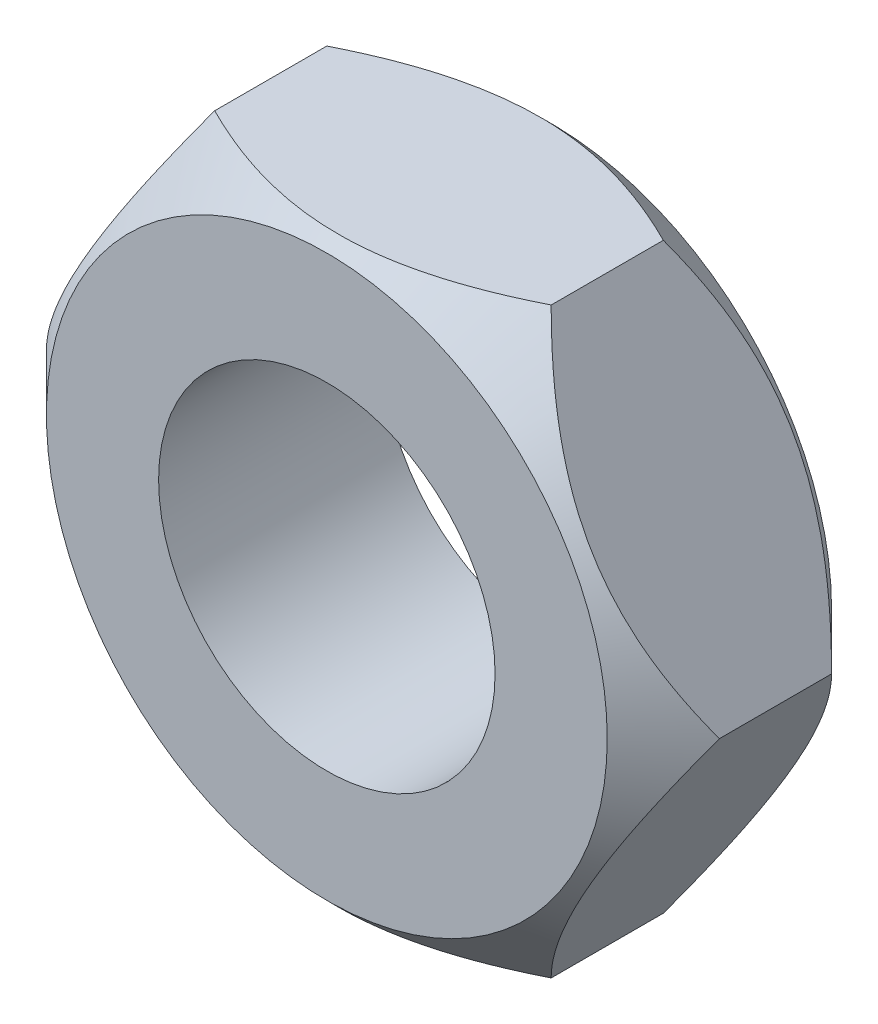
ISO-10303-21;
HEADER;
FILE_DESCRIPTION(('STEP AP214'),'2;1');
FILE_NAME('part.step','',(''),(''),'','','');
FILE_SCHEMA(('AUTOMOTIVE_DESIGN { 1 0 10303 214 1 1 1 1 }'));
ENDSEC;
DATA;
#1=APPLICATION_CONTEXT('core data for automotive mechanical design processes');
#2=APPLICATION_PROTOCOL_DEFINITION('international standard','automotive_design',2000,#1);
#3=PRODUCT_CONTEXT('',#1,'mechanical');
#4=PRODUCT('Part','Part','',(#3));
#5=PRODUCT_RELATED_PRODUCT_CATEGORY('part','',(#4));
#6=PRODUCT_DEFINITION_FORMATION('','',#4);
#7=PRODUCT_DEFINITION_CONTEXT('part definition',#1,'design');
#8=PRODUCT_DEFINITION('design','',#6,#7);
#9=PRODUCT_DEFINITION_SHAPE('','',#8);
#10=(LENGTH_UNIT() NAMED_UNIT(*) SI_UNIT(.MILLI.,.METRE.));
#11=(NAMED_UNIT(*) PLANE_ANGLE_UNIT() SI_UNIT($,.RADIAN.));
#12=(NAMED_UNIT(*) SI_UNIT($,.STERADIAN.) SOLID_ANGLE_UNIT());
#13=UNCERTAINTY_MEASURE_WITH_UNIT(LENGTH_MEASURE(1.E-05),#10,'distance_accuracy_value','');
#14=(GEOMETRIC_REPRESENTATION_CONTEXT(3) GLOBAL_UNCERTAINTY_ASSIGNED_CONTEXT((#13)) GLOBAL_UNIT_ASSIGNED_CONTEXT((#10,
#11,#12)) REPRESENTATION_CONTEXT('',''));
#15=CARTESIAN_POINT('',(0.,0.,0.));
#16=DIRECTION('',(0.,0.,1.));
#17=DIRECTION('',(1.,0.,0.));
#18=AXIS2_PLACEMENT_3D('',#15,#16,#17);
#19=CARTESIAN_POINT('',(0.,0.,-3.));
#20=DIRECTION('',(0.,0.,1.));
#21=DIRECTION('',(1.,0.,0.));
#22=AXIS2_PLACEMENT_3D('',#19,#20,#21);
#23=PLANE('',#22);
#24=CARTESIAN_POINT('',(0.,0.,-3.));
#25=DIRECTION('',(0.,0.,1.));
#26=DIRECTION('',(1.,0.,0.));
#27=AXIS2_PLACEMENT_3D('',#24,#25,#26);
#28=CIRCLE('',#27,4.5);
#29=CARTESIAN_POINT('',(4.5,0.,-3.));
#30=VERTEX_POINT('',#29);
#31=EDGE_CURVE('E206',#30,#30,#28,.T.);
#32=ORIENTED_EDGE('',*,*,#31,.T.);
#33=EDGE_LOOP('',(#32));
#34=FACE_BOUND('',#33,.T.);
#35=CARTESIAN_POINT('',(0.,0.,-3.));
#36=DIRECTION('',(0.,0.,1.));
#37=DIRECTION('',(1.,0.,0.));
#38=AXIS2_PLACEMENT_3D('',#35,#36,#37);
#39=CIRCLE('',#38,7.5);
#40=CARTESIAN_POINT('',(7.5,0.,-3.));
#41=VERTEX_POINT('',#40);
#42=EDGE_CURVE('E99',#41,#41,#39,.T.);
#43=ORIENTED_EDGE('',*,*,#42,.F.);
#44=EDGE_LOOP('',(#43));
#45=FACE_BOUND('',#44,.T.);
#46=ADVANCED_FACE('F35',(#34,#45),#23,.F.);
#47=CARTESIAN_POINT('',(0.,0.,3.));
#48=DIRECTION('',(0.,0.,1.));
#49=DIRECTION('',(1.,0.,0.));
#50=AXIS2_PLACEMENT_3D('',#47,#48,#49);
#51=PLANE('',#50);
#52=CARTESIAN_POINT('',(0.,0.,3.));
#53=DIRECTION('',(0.,0.,1.));
#54=DIRECTION('',(1.,0.,0.));
#55=AXIS2_PLACEMENT_3D('',#52,#53,#54);
#56=CIRCLE('',#55,4.5);
#57=CARTESIAN_POINT('',(4.5,0.,3.));
#58=VERTEX_POINT('',#57);
#59=EDGE_CURVE('E115',#58,#58,#56,.T.);
#60=ORIENTED_EDGE('',*,*,#59,.F.);
#61=EDGE_LOOP('',(#60));
#62=FACE_BOUND('',#61,.T.);
#63=CARTESIAN_POINT('',(0.,0.,3.));
#64=DIRECTION('',(0.,0.,1.));
#65=DIRECTION('',(1.,0.,0.));
#66=AXIS2_PLACEMENT_3D('',#63,#64,#65);
#67=CIRCLE('',#66,7.5);
#68=CARTESIAN_POINT('',(7.5,0.,3.));
#69=VERTEX_POINT('',#68);
#70=EDGE_CURVE('E135',#69,#69,#67,.T.);
#71=ORIENTED_EDGE('',*,*,#70,.T.);
#72=EDGE_LOOP('',(#71));
#73=FACE_BOUND('',#72,.T.);
#74=ADVANCED_FACE('F223',(#62,#73),#51,.T.);
#75=CARTESIAN_POINT('',(9.,0.,3.));
#76=DIRECTION('',(-0.866025403784438,-0.500000000000001,0.));
#77=DIRECTION('',(0.500000000000001,-0.866025403784438,0.));
#78=AXIS2_PLACEMENT_3D('',#75,#76,#77);
#79=PLANE('',#78);
#80=DIRECTION('',(0.,0.,-1.));
#81=VECTOR('',#80,1.);
#82=CARTESIAN_POINT('',(9.,0.,3.));
#83=LINE('',#82,#81);
#84=CARTESIAN_POINT('',(9.,0.,1.5));
#85=VERTEX_POINT('',#84);
#86=CARTESIAN_POINT('',(9.,0.,-1.5));
#87=VERTEX_POINT('',#86);
#88=EDGE_CURVE('E111',#85,#87,#83,.T.);
#89=ORIENTED_EDGE('',*,*,#88,.T.);
#90=CARTESIAN_POINT('',(9.00011547005384,-0.000199999999994475,-1.49988452772397));
#91=CARTESIAN_POINT('',(8.92274192405641,0.133814912829313,-1.57724943822115));
#92=CARTESIAN_POINT('',(8.84477365268686,0.268859920219705,-1.65224010470585));
#93=CARTESIAN_POINT('',(8.68753098792721,0.541212204700925,-1.7967507275746));
#94=CARTESIAN_POINT('',(8.60825590938334,0.678520668512924,-1.8662676961683));
#95=CARTESIAN_POINT('',(8.36755901297594,1.09541992231468,-2.06611750189363));
#96=CARTESIAN_POINT('',(8.20409960905326,1.3785399148837,-2.18689671096131));
#97=CARTESIAN_POINT('',(7.87447067401673,1.94947397801179,-2.39372263743865));
#98=CARTESIAN_POINT('',(7.7083853884696,2.237142130969,-2.48029040430474));
#99=CARTESIAN_POINT('',(7.45652703907505,2.6733735884308,-2.58042793344482));
#100=CARTESIAN_POINT('',(7.37220346119144,2.81942630960118,-2.60884136548566));
#101=CARTESIAN_POINT('',(7.20284235219017,3.1127683552176,-2.65512056900799));
#102=CARTESIAN_POINT('',(7.1178049296914,3.26005749153018,-2.67298791670453));
#103=CARTESIAN_POINT('',(6.91057889128185,3.61898351870673,-2.70294525162354));
#104=CARTESIAN_POINT('',(6.78816699516487,3.83100714223218,-2.70923068335258));
#105=CARTESIAN_POINT('',(6.54356384849813,4.2546722199502,-2.69867971969579));
#106=CARTESIAN_POINT('',(6.42137269032257,4.46631351414595,-2.68183521936724));
#107=CARTESIAN_POINT('',(6.17814239042265,4.88760075151283,-2.62601731093404));
#108=CARTESIAN_POINT('',(6.05710469109561,5.09724419637851,-2.58701915721181));
#109=CARTESIAN_POINT('',(5.81710964124361,5.51292781628721,-2.48901412107608));
#110=CARTESIAN_POINT('',(5.69815213192896,5.71896826636201,-2.43000877296914));
#111=CARTESIAN_POINT('',(5.48698431963075,6.08472164618569,-2.30861852742429));
#112=CARTESIAN_POINT('',(5.39430636677162,6.24524456927917,-2.24942654058235));
#113=CARTESIAN_POINT('',(5.21061408423922,6.56340893558359,-2.12150426182083));
#114=CARTESIAN_POINT('',(5.11959980504949,6.72105029135446,-2.05277368099819));
#115=CARTESIAN_POINT('',(4.93952153885177,7.03295499774782,-1.90731482672894));
#116=CARTESIAN_POINT('',(4.8504524303837,7.18722721899939,-1.83061170476549));
#117=CARTESIAN_POINT('',(4.67396346850877,7.49291506794184,-1.67021472494556));
#118=CARTESIAN_POINT('',(4.58654264354489,7.64433237841887,-1.58652515379037));
#119=CARTESIAN_POINT('',(4.49988452994616,7.79442863405995,-1.49988452772397));
#120=B_SPLINE_CURVE_WITH_KNOTS('',3,(#90,#91,#92,#93,#94,#95,#96,#97,#98,#99,#100,#101,#102,
#103,#104,#105,#106,#107,#108,#109,#110,#111,#112,#113,#114,#115,#116,#117,#118,#119),
.UNSPECIFIED.,.F.,.F.,(4,2,2,2,2,2,2,2,2,2,2,2,2,2,4),(0.,0.518995570787867,1.03827249662172,
2.08243235310213,3.11001247476867,3.62279481108641,4.13550048766921,4.86907230716034,
5.60290124262732,6.33755148088631,7.07214539321498,7.65560480846295,8.23908189927372,
8.82077112592717,9.40210603032024),.UNSPECIFIED.);
#121=CARTESIAN_POINT('',(4.5,7.79422863405995,-1.50000000000001));
#122=VERTEX_POINT('',#121);
#123=EDGE_CURVE('E56',#87,#122,#120,.T.);
#124=ORIENTED_EDGE('',*,*,#123,.T.);
#125=DIRECTION('',(0.,0.,-1.));
#126=VECTOR('',#125,1.);
#127=CARTESIAN_POINT('',(4.5,7.79422863405995,3.));
#128=LINE('',#127,#126);
#129=CARTESIAN_POINT('',(4.5,7.79422863405995,1.50000000000001));
#130=VERTEX_POINT('',#129);
#131=EDGE_CURVE('E49',#130,#122,#128,.T.);
#132=ORIENTED_EDGE('',*,*,#131,.F.);
#133=CARTESIAN_POINT('',(9.00011547005384,-0.000199999999994475,1.49988452772397));
#134=CARTESIAN_POINT('',(8.92274192405641,0.133814912829313,1.57724943822115));
#135=CARTESIAN_POINT('',(8.84477365268686,0.268859920219705,1.65224010470585));
#136=CARTESIAN_POINT('',(8.68753098792721,0.541212204700925,1.7967507275746));
#137=CARTESIAN_POINT('',(8.60825590938334,0.678520668512924,1.8662676961683));
#138=CARTESIAN_POINT('',(8.36755901297594,1.09541992231468,2.06611750189363));
#139=CARTESIAN_POINT('',(8.20409960905326,1.3785399148837,2.18689671096131));
#140=CARTESIAN_POINT('',(7.87447067401673,1.94947397801179,2.39372263743865));
#141=CARTESIAN_POINT('',(7.7083853884696,2.237142130969,2.48029040430474));
#142=CARTESIAN_POINT('',(7.45652703907505,2.6733735884308,2.58042793344482));
#143=CARTESIAN_POINT('',(7.37220346119144,2.81942630960118,2.60884136548566));
#144=CARTESIAN_POINT('',(7.20284235219017,3.1127683552176,2.65512056900799));
#145=CARTESIAN_POINT('',(7.1178049296914,3.26005749153018,2.67298791670453));
#146=CARTESIAN_POINT('',(6.91057889128185,3.61898351870673,2.70294525162354));
#147=CARTESIAN_POINT('',(6.78816699516487,3.83100714223218,2.70923068335258));
#148=CARTESIAN_POINT('',(6.54356384849813,4.2546722199502,2.69867971969579));
#149=CARTESIAN_POINT('',(6.42137269032257,4.46631351414595,2.68183521936724));
#150=CARTESIAN_POINT('',(6.17814239042265,4.88760075151283,2.62601731093404));
#151=CARTESIAN_POINT('',(6.05710469109561,5.09724419637851,2.58701915721181));
#152=CARTESIAN_POINT('',(5.81710964124361,5.51292781628721,2.48901412107608));
#153=CARTESIAN_POINT('',(5.69815213192896,5.71896826636201,2.43000877296914));
#154=CARTESIAN_POINT('',(5.48698431963075,6.08472164618569,2.30861852742429));
#155=CARTESIAN_POINT('',(5.39430636677162,6.24524456927917,2.24942654058235));
#156=CARTESIAN_POINT('',(5.21061408423922,6.56340893558359,2.12150426182083));
#157=CARTESIAN_POINT('',(5.11959980504949,6.72105029135446,2.05277368099819));
#158=CARTESIAN_POINT('',(4.93952153885177,7.03295499774782,1.90731482672894));
#159=CARTESIAN_POINT('',(4.8504524303837,7.18722721899939,1.83061170476549));
#160=CARTESIAN_POINT('',(4.67396346850877,7.49291506794184,1.67021472494556));
#161=CARTESIAN_POINT('',(4.58654264354489,7.64433237841887,1.58652515379037));
#162=CARTESIAN_POINT('',(4.49988452994616,7.79442863405995,1.49988452772397));
#163=B_SPLINE_CURVE_WITH_KNOTS('',3,(#133,#134,#135,#136,#137,#138,#139,#140,#141,#142,#143,
#144,#145,#146,#147,#148,#149,#150,#151,#152,#153,#154,#155,#156,#157,#158,#159,#160,#161,#162),
.UNSPECIFIED.,.F.,.F.,(4,2,2,2,2,2,2,2,2,2,2,2,2,2,4),(0.,0.518995570787867,1.03827249662172,
2.08243235310213,3.11001247476867,3.62279481108641,4.13550048766921,4.86907230716034,
5.60290124262732,6.33755148088631,7.07214539321498,7.65560480846295,8.23908189927372,
8.82077112592717,9.40210603032024),.UNSPECIFIED.);
#164=EDGE_CURVE('E134',#85,#130,#163,.T.);
#165=ORIENTED_EDGE('',*,*,#164,.F.);
#166=EDGE_LOOP('',(#89,#124,#132,#165));
#167=FACE_BOUND('',#166,.T.);
#168=ADVANCED_FACE('F37',(#167),#79,.F.);
#169=CARTESIAN_POINT('',(4.5,7.79422863405995,3.));
#170=DIRECTION('',(0.,-1.,0.));
#171=DIRECTION('',(1.,0.,0.));
#172=AXIS2_PLACEMENT_3D('',#169,#170,#171);
#173=PLANE('',#172);
#174=ORIENTED_EDGE('',*,*,#131,.T.);
#175=CARTESIAN_POINT('',(-11.1620991563945,7.79422863405995,3.11405367909144));
#176=CARTESIAN_POINT('',(-10.8810869819897,7.79422863405995,2.88371165831841));
#177=CARTESIAN_POINT('',(-10.5987192731637,7.79422863405995,2.65499724579427));
#178=CARTESIAN_POINT('',(-10.0305829496493,7.79422863405995,2.20168680077618));
#179=CARTESIAN_POINT('',(-9.74481348740401,7.79422863405995,1.97709183163361));
#180=CARTESIAN_POINT('',(-9.16616685112919,7.79422863405995,1.53056360532577));
#181=CARTESIAN_POINT('',(-8.87324608689188,7.79422863405995,1.30868665113608));
#182=CARTESIAN_POINT('',(-8.28256255023502,7.79422863405995,0.871515461516553));
#183=CARTESIAN_POINT('',(-7.98480024809745,7.79422863405995,0.656220592519402));
#184=CARTESIAN_POINT('',(-7.3553950847762,7.79422863405995,0.214334525646056));
#185=CARTESIAN_POINT('',(-7.02317803755004,7.79422863405995,-0.0114433282564525));
#186=CARTESIAN_POINT('',(-6.34992805988584,7.79422863405995,-0.449813607892143));
#187=CARTESIAN_POINT('',(-6.00889230510091,7.79422863405995,-0.662401733387896));
#188=CARTESIAN_POINT('',(-5.31775906825529,7.79422863405995,-1.06863279468781));
#189=CARTESIAN_POINT('',(-4.96771086802595,7.79422863405995,-1.26235891072349));
#190=CARTESIAN_POINT('',(-4.25514432029652,7.79422863405995,-1.62518521968849));
#191=CARTESIAN_POINT('',(-3.89263707910389,7.79422863405995,-1.7943066762917));
#192=CARTESIAN_POINT('',(-3.39139720162611,7.79422863405995,-2.00075180801446));
#193=CARTESIAN_POINT('',(-3.25872196841599,7.79422863405995,-2.05287494835824));
#194=CARTESIAN_POINT('',(-2.99157923067838,7.79422863405995,-2.15229652975814));
#195=CARTESIAN_POINT('',(-2.85711174278118,7.79422863405995,-2.19959501554694));
#196=CARTESIAN_POINT('',(-2.45099105687163,7.79422863405995,-2.33347808757297));
#197=CARTESIAN_POINT('',(-2.1766139654806,7.79422863405995,-2.41205266934888));
#198=CARTESIAN_POINT('',(-1.62783365357109,7.79422863405995,-2.54195773075186));
#199=CARTESIAN_POINT('',(-1.35356614697257,7.79422863405995,-2.59385412929673));
#200=CARTESIAN_POINT('',(-0.801142304316664,7.79422863405995,-2.66947632315582));
#201=CARTESIAN_POINT('',(-0.522986907084007,7.79422863405995,-2.69320880436159));
#202=CARTESIAN_POINT('',(0.0198477780860744,7.79422863405995,-2.71022284243772));
#203=CARTESIAN_POINT('',(0.284479833998433,7.79422863405995,-2.70501613467059));
#204=CARTESIAN_POINT('',(0.811863094645393,7.79422863405995,-2.66802101865809));
#205=CARTESIAN_POINT('',(1.07461416435402,7.79422863405995,-2.63623072103867));
#206=CARTESIAN_POINT('',(1.6009201968539,7.79422863405995,-2.54737092308457));
#207=CARTESIAN_POINT('',(1.8643937512646,7.79422863405995,-2.48982782638616));
#208=CARTESIAN_POINT('',(2.38546068579431,7.79422863405995,-2.35278183055412));
#209=CARTESIAN_POINT('',(2.64305418600749,7.79422863405995,-2.27327938035338));
#210=CARTESIAN_POINT('',(3.15861145899359,7.79422863405995,-2.09364270273075));
#211=CARTESIAN_POINT('',(3.41640036903056,7.79422863405995,-1.99301292330923));
#212=CARTESIAN_POINT('',(3.92538641098272,7.79422863405995,-1.7761474833603));
#213=CARTESIAN_POINT('',(4.17658059039677,7.79422863405995,-1.65990497069594));
#214=CARTESIAN_POINT('',(4.67353359610828,7.79422863405995,-1.41456796184159));
#215=CARTESIAN_POINT('',(4.91927307294903,7.79422863405995,-1.28543459267839));
#216=CARTESIAN_POINT('',(5.40513600907766,7.79422863405995,-1.01714786134569));
#217=CARTESIAN_POINT('',(5.64526030472537,7.79422863405995,-0.877996004148409));
#218=CARTESIAN_POINT('',(6.10886714542119,7.79422863405995,-0.598699390652143));
#219=CARTESIAN_POINT('',(6.33258547587153,7.79422863405995,-0.458943944753991));
#220=CARTESIAN_POINT('',(6.77617796074432,7.79422863405995,-0.173442576179019));
#221=CARTESIAN_POINT('',(6.99605182835128,7.79422863405995,-0.0276962092456788));
#222=CARTESIAN_POINT('',(7.43070418767735,7.79422863405995,0.267547627721056));
#223=CARTESIAN_POINT('',(7.64550929245777,7.79422863405995,0.417006059633131));
#224=CARTESIAN_POINT('',(8.07216670150533,7.79422863405995,0.71996162982731));
#225=CARTESIAN_POINT('',(8.28401980310787,7.79422863405995,0.873457643894521));
#226=CARTESIAN_POINT('',(8.49463318139958,7.79422863405995,1.02860758663138));
#227=B_SPLINE_CURVE_WITH_KNOTS('',3,(#175,#176,#177,#178,#179,#180,#181,#182,#183,#184,#185,
#186,#187,#188,#189,#190,#191,#192,#193,#194,#195,#196,#197,#198,#199,#200,#201,#202,#203,#204,
#205,#206,#207,#208,#209,#210,#211,#212,#213,#214,#215,#216,#217,#218,#219,#220,#221,#222,#223,
#224,#225,#226),.UNSPECIFIED.,.F.,.F.,(4,2,2,2,2,2,2,2,2,2,2,2,2,2,2,2,2,2,2,2,2,2,2,2,2,4),(0.,
1.0900769787197,2.18043148750662,3.2827581058496,4.38497828206319,5.58977457472789,
6.7949616242112,7.99456715023461,9.19312972313915,9.62068929085086,10.048244894002,
10.9033376953208,11.739453751857,12.5753712813139,13.368046289434,14.1607776400905,
14.9687279448787,15.7766617333048,16.6062344385638,17.4361724247872,18.2686934076857,
19.1010895895943,19.8923269872485,20.6836231653076,21.4686278454679,22.253416217341),.UNSPECIFIED.);
#228=CARTESIAN_POINT('',(-4.5,7.79422863405995,-1.5));
#229=VERTEX_POINT('',#228);
#230=EDGE_CURVE('E130',#122,#229,#227,.F.);
#231=ORIENTED_EDGE('',*,*,#230,.T.);
#232=DIRECTION('',(0.,0.,-1.));
#233=VECTOR('',#232,1.);
#234=CARTESIAN_POINT('',(-4.5,7.79422863405995,3.));
#235=LINE('',#234,#233);
#236=CARTESIAN_POINT('',(-4.5,7.79422863405995,1.5));
#237=VERTEX_POINT('',#236);
#238=EDGE_CURVE('E121',#237,#229,#235,.T.);
#239=ORIENTED_EDGE('',*,*,#238,.F.);
#240=CARTESIAN_POINT('',(-11.2548010520403,7.79422863405995,-3.19016240667025));
#241=CARTESIAN_POINT('',(-10.971492155261,7.79422863405995,-2.95731071864191));
#242=CARTESIAN_POINT('',(-10.6868281796124,7.79422863405995,-2.72608187470901));
#243=CARTESIAN_POINT('',(-10.1140959990685,7.79422863405995,-2.26773366608037));
#244=CARTESIAN_POINT('',(-9.8260269505531,7.79422863405995,-2.04061535662397));
#245=CARTESIAN_POINT('',(-9.24274001293798,7.79422863405995,-1.58899834586564));
#246=CARTESIAN_POINT('',(-8.94747833500547,7.79422863405995,-1.36455601639931));
#247=CARTESIAN_POINT('',(-8.35209828369615,7.79422863405995,-0.922250359228044));
#248=CARTESIAN_POINT('',(-8.05198038593655,7.79422863405995,-0.704386393158121));
#249=CARTESIAN_POINT('',(-7.4171099011505,7.79422863405995,-0.25676850270829));
#250=CARTESIAN_POINT('',(-7.08176967773834,7.79422863405995,-0.0278434601749726));
#251=CARTESIAN_POINT('',(-6.40218336586836,7.79422863405995,0.416754463496932));
#252=CARTESIAN_POINT('',(-6.05793437727658,7.79422863405995,0.632422950015683));
#253=CARTESIAN_POINT('',(-5.36026003552641,7.79422863405995,1.04465898166805));
#254=CARTESIAN_POINT('',(-5.00688484762345,7.79422863405995,1.24131075419088));
#255=CARTESIAN_POINT('',(-4.28745998290209,7.79422863405995,1.60972658595935));
#256=CARTESIAN_POINT('',(-3.92142174358389,7.79422863405995,1.78151241310907));
#257=CARTESIAN_POINT('',(-3.41600313815218,7.79422863405995,1.99090781267047));
#258=CARTESIAN_POINT('',(-3.28281516562792,7.79422863405995,2.04355623898931));
#259=CARTESIAN_POINT('',(-3.01462959144517,7.79422863405995,2.14401352417745));
#260=CARTESIAN_POINT('',(-2.8796320042961,7.79422863405995,2.19182242182364));
#261=CARTESIAN_POINT('',(-2.47189129253119,7.79422863405995,2.3272059658852));
#262=CARTESIAN_POINT('',(-2.19639432560575,7.79422863405995,2.40673995176477));
#263=CARTESIAN_POINT('',(-1.64536713769116,7.79422863405995,2.53838257599432));
#264=CARTESIAN_POINT('',(-1.36997601907202,7.79422863405995,2.59106587442216));
#265=CARTESIAN_POINT('',(-0.815222727192811,7.79422863405995,2.66806078589119));
#266=CARTESIAN_POINT('',(-0.535861535066083,7.79422863405995,2.69237928948848));
#267=CARTESIAN_POINT('',(0.00901692959850005,7.79422863405995,2.71027002312392));
#268=CARTESIAN_POINT('',(0.274483057887093,7.79422863405995,2.70540375646488));
#269=CARTESIAN_POINT('',(0.803552754163376,7.79422863405995,2.66890710013189));
#270=CARTESIAN_POINT('',(1.06715619143223,7.79422863405995,2.63727485053516));
#271=CARTESIAN_POINT('',(1.59519838702573,7.79422863405995,2.54855099277923));
#272=CARTESIAN_POINT('',(1.85955510548325,7.79422863405995,2.49097987457766));
#273=CARTESIAN_POINT('',(2.38235632848998,7.79422863405995,2.35371720116466));
#274=CARTESIAN_POINT('',(2.64080092723652,7.79422863405995,2.27402599865693));
#275=CARTESIAN_POINT('',(3.15704667692662,7.79422863405995,2.09422710830211));
#276=CARTESIAN_POINT('',(3.41469770353693,7.79422863405995,1.99369386403025));
#277=CARTESIAN_POINT('',(3.92341498510677,7.79422863405995,1.77703169391951));
#278=CARTESIAN_POINT('',(4.17447830035004,7.79422863405995,1.66089594243867));
#279=CARTESIAN_POINT('',(4.67117288032179,7.79422863405995,1.41578002589854));
#280=CARTESIAN_POINT('',(4.91678485673412,7.79422863405995,1.28676109636306));
#281=CARTESIAN_POINT('',(5.40239713261847,7.79422863405995,1.0187071650527));
#282=CARTESIAN_POINT('',(5.64239826543062,7.79422863405995,0.879673663353506));
#283=CARTESIAN_POINT('',(6.10576936434461,7.79422863405995,0.600609296252845));
#284=CARTESIAN_POINT('',(6.32937494003327,7.79422863405995,0.460967576306555));
#285=CARTESIAN_POINT('',(6.77274380969818,7.79422863405995,0.175694884685113));
#286=CARTESIAN_POINT('',(6.99250681738233,7.79422863405995,0.0300634694322027));
#287=CARTESIAN_POINT('',(7.42694157134757,7.79422863405995,-0.264952001537408));
#288=CARTESIAN_POINT('',(7.64163989122344,7.79422863405995,-0.414297066405314));
#289=CARTESIAN_POINT('',(8.06808468492379,7.79422863405995,-0.717025670649316));
#290=CARTESIAN_POINT('',(8.27983195572517,7.79422863405995,-0.870408086033687));
#291=CARTESIAN_POINT('',(8.49033977931354,7.79422863405995,-1.02544444124362));
#292=B_SPLINE_CURVE_WITH_KNOTS('',3,(#240,#241,#242,#243,#244,#245,#246,#247,#248,#249,#250,
#251,#252,#253,#254,#255,#256,#257,#258,#259,#260,#261,#262,#263,#264,#265,#266,#267,#268,#269,
#270,#271,#272,#273,#274,#275,#276,#277,#278,#279,#280,#281,#282,#283,#284,#285,#286,#287,#288,
#289,#290,#291),.UNSPECIFIED.,.F.,.F.,(4,2,2,2,2,2,2,2,2,2,2,2,2,2,2,2,2,2,2,2,2,2,2,2,2,4),(0.,
1.10017948775898,2.20063751364678,3.31321138682578,4.42567694647695,5.64353226798723,
6.8617891616102,8.07437607910077,9.28589498114463,9.71546315403553,10.1450278847233,
11.0041382072407,11.8439958439676,12.6836494146228,13.4787935516908,14.2739929465147,
15.0845372986179,15.895068727372,16.7241521304457,17.5535994216126,18.3856222998555,
19.217520808116,20.0082905748898,20.7991190093737,21.5836664727437,22.3679977824981),.UNSPECIFIED.);
#293=EDGE_CURVE('E131',#130,#237,#292,.F.);
#294=ORIENTED_EDGE('',*,*,#293,.F.);
#295=EDGE_LOOP('',(#174,#231,#239,#294));
#296=FACE_BOUND('',#295,.T.);
#297=ADVANCED_FACE('F128',(#296),#173,.F.);
#298=CARTESIAN_POINT('',(-4.5,7.79422863405995,3.));
#299=DIRECTION('',(0.866025403784439,-0.5,0.));
#300=DIRECTION('',(0.5,0.866025403784439,0.));
#301=AXIS2_PLACEMENT_3D('',#298,#299,#300);
#302=PLANE('',#301);
#303=ORIENTED_EDGE('',*,*,#238,.T.);
#304=CARTESIAN_POINT('',(-4.49988452994616,7.79442863405995,-1.49988452772397));
#305=CARTESIAN_POINT('',(-4.57725807594359,7.66041372123064,-1.57724943822115));
#306=CARTESIAN_POINT('',(-4.65522634731315,7.52536871384025,-1.65224010470585));
#307=CARTESIAN_POINT('',(-4.81246901207279,7.25301642935903,-1.7967507275746));
#308=CARTESIAN_POINT('',(-4.89174409061666,7.11570796554703,-1.8662676961683));
#309=CARTESIAN_POINT('',(-5.13244098702406,6.69880871174527,-2.06611750189364));
#310=CARTESIAN_POINT('',(-5.29590039094675,6.41568871917625,-2.18689671096131));
#311=CARTESIAN_POINT('',(-5.62552932598328,5.84475465604816,-2.39372263743865));
#312=CARTESIAN_POINT('',(-5.7916146115304,5.55708650309095,-2.48029040430474));
#313=CARTESIAN_POINT('',(-6.04347296092496,5.12085504562915,-2.58042793344482));
#314=CARTESIAN_POINT('',(-6.12779653880856,4.97480232445877,-2.60884136548566));
#315=CARTESIAN_POINT('',(-6.29715764780983,4.68146027884235,-2.65512056900799));
#316=CARTESIAN_POINT('',(-6.3821950703086,4.53417114252977,-2.67298791670453));
#317=CARTESIAN_POINT('',(-6.58942110871815,4.17524511535322,-2.70294525162354));
#318=CARTESIAN_POINT('',(-6.71183300483513,3.96322149182777,-2.70923068335258));
#319=CARTESIAN_POINT('',(-6.95643615150187,3.53955641410975,-2.69867971969579));
#320=CARTESIAN_POINT('',(-7.07862730967743,3.327915119914,-2.68183521936724));
#321=CARTESIAN_POINT('',(-7.32185760957735,2.90662788254712,-2.62601731093404));
#322=CARTESIAN_POINT('',(-7.44289530890439,2.69698443768144,-2.58701915721181));
#323=CARTESIAN_POINT('',(-7.68289035875639,2.28130081777274,-2.48901412107608));
#324=CARTESIAN_POINT('',(-7.80184786807103,2.07526036769794,-2.43000877296914));
#325=CARTESIAN_POINT('',(-8.01301568036925,1.70950698787426,-2.30861852742429));
#326=CARTESIAN_POINT('',(-8.10569363322838,1.54898406478078,-2.24942654058235));
#327=CARTESIAN_POINT('',(-8.28938591576078,1.23081969847636,-2.12150426182083));
#328=CARTESIAN_POINT('',(-8.38040019495051,1.07317834270549,-2.05277368099819));
#329=CARTESIAN_POINT('',(-8.56047846114823,0.761273636312127,-1.90731482672894));
#330=CARTESIAN_POINT('',(-8.6495475696163,0.607001415060558,-1.83061170476548));
#331=CARTESIAN_POINT('',(-8.82603653149123,0.301313566118102,-1.67021472494556));
#332=CARTESIAN_POINT('',(-8.91345735645511,0.14989625564107,-1.58652515379037));
#333=CARTESIAN_POINT('',(-9.00011547005384,-0.000200000000006928,-1.49988452772397));
#334=B_SPLINE_CURVE_WITH_KNOTS('',3,(#304,#305,#306,#307,#308,#309,#310,#311,#312,#313,#314,
#315,#316,#317,#318,#319,#320,#321,#322,#323,#324,#325,#326,#327,#328,#329,#330,#331,#332,#333),
.UNSPECIFIED.,.F.,.F.,(4,2,2,2,2,2,2,2,2,2,2,2,2,2,4),(0.,0.518995570787867,1.03827249662172,
2.08243235310214,3.11001247476867,3.62279481108642,4.13550048766922,4.86907230716034,
5.60290124262733,6.33755148088632,7.07214539321498,7.65560480846296,8.23908189927372,
8.82077112592718,9.40210603032025),.UNSPECIFIED.);
#335=CARTESIAN_POINT('',(-9.,0.,-1.5));
#336=VERTEX_POINT('',#335);
#337=EDGE_CURVE('E139',#229,#336,#334,.T.);
#338=ORIENTED_EDGE('',*,*,#337,.T.);
#339=DIRECTION('',(0.,0.,-1.));
#340=VECTOR('',#339,1.);
#341=CARTESIAN_POINT('',(-9.,0.,3.));
#342=LINE('',#341,#340);
#343=CARTESIAN_POINT('',(-9.,0.,1.5));
#344=VERTEX_POINT('',#343);
#345=EDGE_CURVE('E113',#344,#336,#342,.T.);
#346=ORIENTED_EDGE('',*,*,#345,.F.);
#347=CARTESIAN_POINT('',(-4.49988452994616,7.79442863405995,1.49988452772397));
#348=CARTESIAN_POINT('',(-4.57725807594359,7.66041372123064,1.57724943822115));
#349=CARTESIAN_POINT('',(-4.65522634731315,7.52536871384025,1.65224010470585));
#350=CARTESIAN_POINT('',(-4.81246901207279,7.25301642935903,1.7967507275746));
#351=CARTESIAN_POINT('',(-4.89174409061666,7.11570796554703,1.8662676961683));
#352=CARTESIAN_POINT('',(-5.13244098702406,6.69880871174527,2.06611750189364));
#353=CARTESIAN_POINT('',(-5.29590039094675,6.41568871917625,2.18689671096131));
#354=CARTESIAN_POINT('',(-5.62552932598328,5.84475465604816,2.39372263743865));
#355=CARTESIAN_POINT('',(-5.7916146115304,5.55708650309095,2.48029040430474));
#356=CARTESIAN_POINT('',(-6.04347296092496,5.12085504562915,2.58042793344482));
#357=CARTESIAN_POINT('',(-6.12779653880856,4.97480232445877,2.60884136548566));
#358=CARTESIAN_POINT('',(-6.29715764780983,4.68146027884235,2.65512056900799));
#359=CARTESIAN_POINT('',(-6.3821950703086,4.53417114252977,2.67298791670453));
#360=CARTESIAN_POINT('',(-6.58942110871815,4.17524511535322,2.70294525162354));
#361=CARTESIAN_POINT('',(-6.71183300483513,3.96322149182777,2.70923068335258));
#362=CARTESIAN_POINT('',(-6.95643615150187,3.53955641410975,2.69867971969579));
#363=CARTESIAN_POINT('',(-7.07862730967743,3.327915119914,2.68183521936724));
#364=CARTESIAN_POINT('',(-7.32185760957735,2.90662788254712,2.62601731093404));
#365=CARTESIAN_POINT('',(-7.44289530890439,2.69698443768144,2.58701915721181));
#366=CARTESIAN_POINT('',(-7.68289035875639,2.28130081777274,2.48901412107608));
#367=CARTESIAN_POINT('',(-7.80184786807103,2.07526036769794,2.43000877296914));
#368=CARTESIAN_POINT('',(-8.01301568036925,1.70950698787426,2.30861852742429));
#369=CARTESIAN_POINT('',(-8.10569363322838,1.54898406478078,2.24942654058235));
#370=CARTESIAN_POINT('',(-8.28938591576078,1.23081969847636,2.12150426182083));
#371=CARTESIAN_POINT('',(-8.38040019495051,1.07317834270549,2.05277368099819));
#372=CARTESIAN_POINT('',(-8.56047846114823,0.761273636312127,1.90731482672894));
#373=CARTESIAN_POINT('',(-8.6495475696163,0.607001415060558,1.83061170476548));
#374=CARTESIAN_POINT('',(-8.82603653149123,0.301313566118102,1.67021472494556));
#375=CARTESIAN_POINT('',(-8.91345735645511,0.14989625564107,1.58652515379037));
#376=CARTESIAN_POINT('',(-9.00011547005384,-0.000200000000006928,1.49988452772397));
#377=B_SPLINE_CURVE_WITH_KNOTS('',3,(#347,#348,#349,#350,#351,#352,#353,#354,#355,#356,#357,
#358,#359,#360,#361,#362,#363,#364,#365,#366,#367,#368,#369,#370,#371,#372,#373,#374,#375,#376),
.UNSPECIFIED.,.F.,.F.,(4,2,2,2,2,2,2,2,2,2,2,2,2,2,4),(0.,0.518995570787867,1.03827249662172,
2.08243235310214,3.11001247476867,3.62279481108642,4.13550048766922,4.86907230716034,
5.60290124262733,6.33755148088632,7.07214539321498,7.65560480846296,8.23908189927372,
8.82077112592718,9.40210603032025),.UNSPECIFIED.);
#378=EDGE_CURVE('E188',#237,#344,#377,.T.);
#379=ORIENTED_EDGE('',*,*,#378,.F.);
#380=EDGE_LOOP('',(#303,#338,#346,#379));
#381=FACE_BOUND('',#380,.T.);
#382=ADVANCED_FACE('F179',(#381),#302,.F.);
#383=CARTESIAN_POINT('',(-9.,0.,3.));
#384=DIRECTION('',(0.866025403784438,0.500000000000001,0.));
#385=DIRECTION('',(-0.500000000000001,0.866025403784438,0.));
#386=AXIS2_PLACEMENT_3D('',#383,#384,#385);
#387=PLANE('',#386);
#388=ORIENTED_EDGE('',*,*,#345,.T.);
#389=CARTESIAN_POINT('',(-9.00011547005384,0.000199999999993714,-1.49988452772397));
#390=CARTESIAN_POINT('',(-8.92274192405641,-0.133814912829313,-1.57724943822115));
#391=CARTESIAN_POINT('',(-8.84477365268686,-0.268859920219705,-1.65224010470585));
#392=CARTESIAN_POINT('',(-8.68753098792721,-0.541212204700926,-1.7967507275746));
#393=CARTESIAN_POINT('',(-8.60825590938334,-0.678520668512925,-1.8662676961683));
#394=CARTESIAN_POINT('',(-8.36755901297594,-1.09541992231468,-2.06611750189363));
#395=CARTESIAN_POINT('',(-8.20409960905326,-1.37853991488369,-2.18689671096131));
#396=CARTESIAN_POINT('',(-7.87447067401673,-1.94947397801179,-2.39372263743865));
#397=CARTESIAN_POINT('',(-7.7083853884696,-2.237142130969,-2.48029040430474));
#398=CARTESIAN_POINT('',(-7.45652703907505,-2.6733735884308,-2.58042793344482));
#399=CARTESIAN_POINT('',(-7.37220346119144,-2.81942630960119,-2.60884136548566));
#400=CARTESIAN_POINT('',(-7.20284235219017,-3.1127683552176,-2.65512056900799));
#401=CARTESIAN_POINT('',(-7.1178049296914,-3.26005749153018,-2.67298791670453));
#402=CARTESIAN_POINT('',(-6.91057889128185,-3.61898351870673,-2.70294525162354));
#403=CARTESIAN_POINT('',(-6.78816699516487,-3.83100714223218,-2.70923068335258));
#404=CARTESIAN_POINT('',(-6.54356384849813,-4.2546722199502,-2.69867971969579));
#405=CARTESIAN_POINT('',(-6.42137269032257,-4.46631351414595,-2.68183521936724));
#406=CARTESIAN_POINT('',(-6.17814239042265,-4.88760075151283,-2.62601731093404));
#407=CARTESIAN_POINT('',(-6.05710469109561,-5.09724419637852,-2.58701915721181));
#408=CARTESIAN_POINT('',(-5.8171096412436,-5.51292781628721,-2.48901412107608));
#409=CARTESIAN_POINT('',(-5.69815213192896,-5.71896826636201,-2.43000877296914));
#410=CARTESIAN_POINT('',(-5.48698431963075,-6.08472164618569,-2.30861852742429));
#411=CARTESIAN_POINT('',(-5.39430636677162,-6.24524456927917,-2.24942654058234));
#412=CARTESIAN_POINT('',(-5.21061408423922,-6.56340893558359,-2.12150426182083));
#413=CARTESIAN_POINT('',(-5.11959980504949,-6.72105029135446,-2.05277368099819));
#414=CARTESIAN_POINT('',(-4.93952153885177,-7.03295499774782,-1.90731482672894));
#415=CARTESIAN_POINT('',(-4.8504524303837,-7.18722721899939,-1.83061170476548));
#416=CARTESIAN_POINT('',(-4.67396346850877,-7.49291506794184,-1.67021472494556));
#417=CARTESIAN_POINT('',(-4.58654264354489,-7.64433237841887,-1.58652515379037));
#418=CARTESIAN_POINT('',(-4.49988452994616,-7.79442863405995,-1.49988452772397));
#419=B_SPLINE_CURVE_WITH_KNOTS('',3,(#389,#390,#391,#392,#393,#394,#395,#396,#397,#398,#399,
#400,#401,#402,#403,#404,#405,#406,#407,#408,#409,#410,#411,#412,#413,#414,#415,#416,#417,#418),
.UNSPECIFIED.,.F.,.F.,(4,2,2,2,2,2,2,2,2,2,2,2,2,2,4),(0.,0.518995570787866,1.03827249662172,
2.08243235310213,3.11001247476867,3.62279481108641,4.13550048766921,4.86907230716034,
5.60290124262733,6.33755148088632,7.07214539321498,7.65560480846296,8.23908189927372,
8.82077112592717,9.40210603032024),.UNSPECIFIED.);
#420=CARTESIAN_POINT('',(-4.5,-7.79422863405995,-1.50000000000001));
#421=VERTEX_POINT('',#420);
#422=EDGE_CURVE('E108',#336,#421,#419,.T.);
#423=ORIENTED_EDGE('',*,*,#422,.T.);
#424=DIRECTION('',(0.,0.,-1.));
#425=VECTOR('',#424,1.);
#426=CARTESIAN_POINT('',(-4.5,-7.79422863405995,3.));
#427=LINE('',#426,#425);
#428=CARTESIAN_POINT('',(-4.5,-7.79422863405995,1.50000000000001));
#429=VERTEX_POINT('',#428);
#430=EDGE_CURVE('E107',#429,#421,#427,.T.);
#431=ORIENTED_EDGE('',*,*,#430,.F.);
#432=CARTESIAN_POINT('',(-9.00011547005384,0.000199999999993714,1.49988452772397));
#433=CARTESIAN_POINT('',(-8.92274192405641,-0.133814912829313,1.57724943822115));
#434=CARTESIAN_POINT('',(-8.84477365268686,-0.268859920219705,1.65224010470585));
#435=CARTESIAN_POINT('',(-8.68753098792721,-0.541212204700926,1.7967507275746));
#436=CARTESIAN_POINT('',(-8.60825590938334,-0.678520668512925,1.8662676961683));
#437=CARTESIAN_POINT('',(-8.36755901297594,-1.09541992231468,2.06611750189363));
#438=CARTESIAN_POINT('',(-8.20409960905326,-1.37853991488369,2.18689671096131));
#439=CARTESIAN_POINT('',(-7.87447067401673,-1.94947397801179,2.39372263743865));
#440=CARTESIAN_POINT('',(-7.7083853884696,-2.237142130969,2.48029040430474));
#441=CARTESIAN_POINT('',(-7.45652703907505,-2.6733735884308,2.58042793344482));
#442=CARTESIAN_POINT('',(-7.37220346119144,-2.81942630960119,2.60884136548566));
#443=CARTESIAN_POINT('',(-7.20284235219017,-3.1127683552176,2.65512056900799));
#444=CARTESIAN_POINT('',(-7.1178049296914,-3.26005749153018,2.67298791670453));
#445=CARTESIAN_POINT('',(-6.91057889128185,-3.61898351870673,2.70294525162354));
#446=CARTESIAN_POINT('',(-6.78816699516487,-3.83100714223218,2.70923068335258));
#447=CARTESIAN_POINT('',(-6.54356384849813,-4.2546722199502,2.69867971969579));
#448=CARTESIAN_POINT('',(-6.42137269032257,-4.46631351414595,2.68183521936724));
#449=CARTESIAN_POINT('',(-6.17814239042265,-4.88760075151283,2.62601731093404));
#450=CARTESIAN_POINT('',(-6.05710469109561,-5.09724419637852,2.58701915721181));
#451=CARTESIAN_POINT('',(-5.8171096412436,-5.51292781628721,2.48901412107608));
#452=CARTESIAN_POINT('',(-5.69815213192896,-5.71896826636201,2.43000877296914));
#453=CARTESIAN_POINT('',(-5.48698431963075,-6.08472164618569,2.30861852742429));
#454=CARTESIAN_POINT('',(-5.39430636677162,-6.24524456927917,2.24942654058234));
#455=CARTESIAN_POINT('',(-5.21061408423922,-6.56340893558359,2.12150426182083));
#456=CARTESIAN_POINT('',(-5.11959980504949,-6.72105029135446,2.05277368099819));
#457=CARTESIAN_POINT('',(-4.93952153885177,-7.03295499774782,1.90731482672894));
#458=CARTESIAN_POINT('',(-4.8504524303837,-7.18722721899939,1.83061170476548));
#459=CARTESIAN_POINT('',(-4.67396346850877,-7.49291506794184,1.67021472494556));
#460=CARTESIAN_POINT('',(-4.58654264354489,-7.64433237841887,1.58652515379037));
#461=CARTESIAN_POINT('',(-4.49988452994616,-7.79442863405995,1.49988452772397));
#462=B_SPLINE_CURVE_WITH_KNOTS('',3,(#432,#433,#434,#435,#436,#437,#438,#439,#440,#441,#442,
#443,#444,#445,#446,#447,#448,#449,#450,#451,#452,#453,#454,#455,#456,#457,#458,#459,#460,#461),
.UNSPECIFIED.,.F.,.F.,(4,2,2,2,2,2,2,2,2,2,2,2,2,2,4),(0.,0.518995570787866,1.03827249662172,
2.08243235310213,3.11001247476867,3.62279481108641,4.13550048766921,4.86907230716034,
5.60290124262733,6.33755148088632,7.07214539321498,7.65560480846296,8.23908189927372,
8.82077112592717,9.40210603032024),.UNSPECIFIED.);
#463=EDGE_CURVE('E194',#344,#429,#462,.T.);
#464=ORIENTED_EDGE('',*,*,#463,.F.);
#465=EDGE_LOOP('',(#388,#423,#431,#464));
#466=FACE_BOUND('',#465,.T.);
#467=ADVANCED_FACE('F182',(#466),#387,.F.);
#468=CARTESIAN_POINT('',(-4.5,-7.79422863405995,3.));
#469=DIRECTION('',(0.,1.,0.));
#470=DIRECTION('',(-1.,0.,0.));
#471=AXIS2_PLACEMENT_3D('',#468,#469,#470);
#472=PLANE('',#471);
#473=ORIENTED_EDGE('',*,*,#430,.T.);
#474=CARTESIAN_POINT('',(-11.1620991557257,-7.79422863405995,3.11405367854304));
#475=CARTESIAN_POINT('',(-10.8810869813411,-7.79422863405995,2.88371165779116));
#476=CARTESIAN_POINT('',(-10.5987192725355,-7.79422863405995,2.65499724528816));
#477=CARTESIAN_POINT('',(-10.0305829490618,-7.79422863405995,2.20168680031231));
#478=CARTESIAN_POINT('',(-9.74481348683695,-7.79422863405995,1.97709183119082));
#479=CARTESIAN_POINT('',(-9.16616685060374,-7.79422863405995,1.53056360492553));
#480=CARTESIAN_POINT('',(-8.8732460863876,-7.79422863405995,1.30868665075729));
#481=CARTESIAN_POINT('',(-8.28256254977336,-7.79422863405995,0.871515461180438));
#482=CARTESIAN_POINT('',(-7.98480024765724,-7.79422863405995,0.656220592204514));
#483=CARTESIAN_POINT('',(-7.35539508438382,-7.79422863405995,0.214334525376952));
#484=CARTESIAN_POINT('',(-7.02317803718412,-7.79422863405995,-0.0114433285011111));
#485=CARTESIAN_POINT('',(-6.34992805957382,-7.79422863405995,-0.449813608088906));
#486=CARTESIAN_POINT('',(-6.00889230481631,-7.79422863405995,-0.66240173356121));
#487=CARTESIAN_POINT('',(-5.31775906802658,-7.79422863405995,-1.06863279481622));
#488=CARTESIAN_POINT('',(-4.96771086782569,-7.79422863405995,-1.26235891083045));
#489=CARTESIAN_POINT('',(-4.25514432015502,-7.79422863405995,-1.62518521975556));
#490=CARTESIAN_POINT('',(-3.89263707899271,-7.79422863405995,-1.79430667634035));
#491=CARTESIAN_POINT('',(-3.39139720154107,-7.79422863405995,-2.00075180804847));
#492=CARTESIAN_POINT('',(-3.25872196832551,-7.79422863405995,-2.05287494839324));
#493=CARTESIAN_POINT('',(-2.99157923057688,-7.79422863405995,-2.15229652979459));
#494=CARTESIAN_POINT('',(-2.85711174267412,-7.79422863405995,-2.19959501558389));
#495=CARTESIAN_POINT('',(-2.45099105674768,-7.79422863405995,-2.33347808761053));
#496=CARTESIAN_POINT('',(-2.17661396534516,-7.79422863405995,-2.41205266938574));
#497=CARTESIAN_POINT('',(-1.62783365341304,-7.79422863405995,-2.54195773078458));
#498=CARTESIAN_POINT('',(-1.35356614680341,-7.79422863405995,-2.5938541293261));
#499=CARTESIAN_POINT('',(-0.801142304125557,-7.79422863405995,-2.66947632317578));
#500=CARTESIAN_POINT('',(-0.52298690688206,-7.79422863405995,-2.6932088043755));
#501=CARTESIAN_POINT('',(0.0198477783055726,-7.79422863405995,-2.71022284243741));
#502=CARTESIAN_POINT('',(0.284479834224673,-7.79422863405995,-2.70501613466253));
#503=CARTESIAN_POINT('',(0.811863094884251,-7.79422863405995,-2.66802101863352));
#504=CARTESIAN_POINT('',(1.07461416459875,-7.79422863405995,-2.63623072100536));
#505=CARTESIAN_POINT('',(1.60092019711024,-7.79422863405995,-2.54737092303312));
#506=CARTESIAN_POINT('',(1.86439375152665,-7.79422863405995,-2.48982782632527));
#507=CARTESIAN_POINT('',(2.38546068606708,-7.79422863405995,-2.35278183047434));
#508=CARTESIAN_POINT('',(2.64305418628529,-7.79422863405995,-2.27327938026418));
#509=CARTESIAN_POINT('',(3.15861145930274,-7.79422863405995,-2.09364270261523));
#510=CARTESIAN_POINT('',(3.41640036936547,-7.79422863405995,-1.99301292317523));
#511=CARTESIAN_POINT('',(3.92538641136787,-7.79422863405995,-1.7761474831875));
#512=CARTESIAN_POINT('',(4.17658059080637,-7.79422863405995,-1.6599049705028));
#513=CARTESIAN_POINT('',(4.67353359656592,-7.79422863405995,-1.41456796160655));
#514=CARTESIAN_POINT('',(4.91927307343024,-7.79422863405995,-1.28543459242178));
#515=CARTESIAN_POINT('',(5.40513600960523,-7.79422863405995,-1.01714786104526));
#516=CARTESIAN_POINT('',(5.64526030527574,-7.79422863405995,-0.877996003825727));
#517=CARTESIAN_POINT('',(6.10886714601283,-7.79422863405995,-0.59869939028727));
#518=CARTESIAN_POINT('',(6.33258547648172,-7.79422863405995,-0.458943944369284));
#519=CARTESIAN_POINT('',(6.77617796139135,-7.79422863405995,-0.173442575754562));
#520=CARTESIAN_POINT('',(6.9960518290166,-7.79422863405995,-0.0276962088013063));
#521=CARTESIAN_POINT('',(7.4307041883788,-7.79422863405995,0.267547628205033));
#522=CARTESIAN_POINT('',(7.64550929317705,-7.79422863405995,0.417006060136795));
#523=CARTESIAN_POINT('',(8.07216670226019,-7.79422863405995,0.719961630370319));
#524=CARTESIAN_POINT('',(8.28401980388045,-7.79422863405995,0.87345764445719));
#525=CARTESIAN_POINT('',(8.49463318218986,-7.79422863405995,1.02860758721368));
#526=B_SPLINE_CURVE_WITH_KNOTS('',3,(#474,#475,#476,#477,#478,#479,#480,#481,#482,#483,#484,
#485,#486,#487,#488,#489,#490,#491,#492,#493,#494,#495,#496,#497,#498,#499,#500,#501,#502,#503,
#504,#505,#506,#507,#508,#509,#510,#511,#512,#513,#514,#515,#516,#517,#518,#519,#520,#521,#522,
#523,#524,#525),.UNSPECIFIED.,.F.,.F.,(4,2,2,2,2,2,2,2,2,2,2,2,2,2,2,2,2,2,2,2,2,2,2,2,2,4),(0.,
1.09007697863242,2.18043148733203,3.28275810558552,4.38497828170965,5.58977457426747,
6.79496162364378,7.99456714956143,9.19312972236049,9.62068929008845,10.0482448932558,
10.903337694607,11.7394537511739,12.5753712806615,13.3680462888021,14.1607776394792,
14.9687279442902,15.7766617327391,16.6062344380901,17.4361724244056,18.2686934073969,
19.101089589398,19.892326987131,20.6836231652688,21.4686278455068,22.2534162174575),.UNSPECIFIED.);
#527=CARTESIAN_POINT('',(4.5,-7.79422863405995,-1.5));
#528=VERTEX_POINT('',#527);
#529=EDGE_CURVE('E93',#421,#528,#526,.T.);
#530=ORIENTED_EDGE('',*,*,#529,.T.);
#531=DIRECTION('',(0.,0.,-1.));
#532=VECTOR('',#531,1.);
#533=CARTESIAN_POINT('',(4.5,-7.79422863405995,3.));
#534=LINE('',#533,#532);
#535=CARTESIAN_POINT('',(4.5,-7.79422863405995,1.5));
#536=VERTEX_POINT('',#535);
#537=EDGE_CURVE('E105',#536,#528,#534,.T.);
#538=ORIENTED_EDGE('',*,*,#537,.F.);
#539=CARTESIAN_POINT('',(-11.2548010507546,-7.79422863405995,-3.19016240561326));
#540=CARTESIAN_POINT('',(-10.9714921540144,-7.79422863405995,-2.95731071762566));
#541=CARTESIAN_POINT('',(-10.6868281784049,-7.79422863405995,-2.72608187373347));
#542=CARTESIAN_POINT('',(-10.1140959979395,-7.79422863405995,-2.26773366518616));
#543=CARTESIAN_POINT('',(-9.82602694946344,-7.79422863405995,-2.04061535577037));
#544=CARTESIAN_POINT('',(-9.24274001192843,-7.79422863405995,-1.58899834509398));
#545=CARTESIAN_POINT('',(-8.94747833403668,-7.79422863405995,-1.36455601566897));
#546=CARTESIAN_POINT('',(-8.35209828280941,-7.79422863405995,-0.922250358579916));
#547=CARTESIAN_POINT('',(-8.05198038509109,-7.79422863405995,-0.704386392550887));
#548=CARTESIAN_POINT('',(-7.41710990039718,-7.79422863405995,-0.256768502189376));
#549=CARTESIAN_POINT('',(-7.08176967703606,-7.79422863405995,-0.0278434597032702));
#550=CARTESIAN_POINT('',(-6.40218336527,-7.79422863405995,0.416754463876116));
#551=CARTESIAN_POINT('',(-6.0579343767311,-7.79422863405995,0.632422950349561));
#552=CARTESIAN_POINT('',(-5.36026003508868,-7.79422863405995,1.04465898191517));
#553=CARTESIAN_POINT('',(-5.00688484724056,-7.79422863405995,1.24131075439651));
#554=CARTESIAN_POINT('',(-4.2874599826325,-7.79422863405995,1.60972658608787));
#555=CARTESIAN_POINT('',(-3.92142174337276,-7.79422863405995,1.78151241320196));
#556=CARTESIAN_POINT('',(-3.41600313799148,-7.79422863405995,1.99090781273513));
#557=CARTESIAN_POINT('',(-3.28281516545675,-7.79422863405995,2.04355623905592));
#558=CARTESIAN_POINT('',(-3.0146295912528,-7.79422863405995,2.14401352424701));
#559=CARTESIAN_POINT('',(-2.879632004093,-7.79422863405995,2.19182242189421));
#560=CARTESIAN_POINT('',(-2.47189129229557,-7.79422863405995,2.32720596595717));
#561=CARTESIAN_POINT('',(-2.19639432534798,-7.79422863405995,2.40673995183553));
#562=CARTESIAN_POINT('',(-1.64536713738979,-7.79422863405995,2.53838257605736));
#563=CARTESIAN_POINT('',(-1.36997601874925,-7.79422863405995,2.59106587447886));
#564=CARTESIAN_POINT('',(-0.815222726827725,-7.79422863405995,2.66806078592998));
#565=CARTESIAN_POINT('',(-0.535861534680088,-7.79422863405995,2.69237928951571));
#566=CARTESIAN_POINT('',(0.00901693001801354,-7.79422863405995,2.71027002312391));
#567=CARTESIAN_POINT('',(0.274483058319272,-7.79422863405995,2.70540375645002));
#568=CARTESIAN_POINT('',(0.803552754619231,-7.79422863405995,2.66890710008548));
#569=CARTESIAN_POINT('',(1.0671561918991,-7.79422863405995,2.63727485047204));
#570=CARTESIAN_POINT('',(1.59519838751434,-7.79422863405995,2.54855099268149));
#571=CARTESIAN_POINT('',(1.85955510598256,-7.79422863405995,2.4909798744619));
#572=CARTESIAN_POINT('',(2.38235632900934,-7.79422863405995,2.35371720101294));
#573=CARTESIAN_POINT('',(2.64080092776527,-7.79422863405995,2.27402599848728));
#574=CARTESIAN_POINT('',(3.15704667751483,-7.79422863405995,2.09422710808241));
#575=CARTESIAN_POINT('',(3.41469770417414,-7.79422863405995,1.99369386377541));
#576=CARTESIAN_POINT('',(3.92341498583949,-7.79422863405995,1.77703169359088));
#577=CARTESIAN_POINT('',(4.17447830112926,-7.79422863405995,1.66089594207139));
#578=CARTESIAN_POINT('',(4.67117288119235,-7.79422863405995,1.4157800254516));
#579=CARTESIAN_POINT('',(4.9167848576495,-7.79422863405995,1.28676109587511));
#580=CARTESIAN_POINT('',(5.40239713362202,-7.79422863405995,1.01870716448142));
#581=CARTESIAN_POINT('',(5.64239826647752,-7.79422863405995,0.879673662739917));
#582=CARTESIAN_POINT('',(6.10576936546996,-7.79422863405995,0.600609295559041));
#583=CARTESIAN_POINT('',(6.32937494119389,-7.79422863405995,0.460967575575048));
#584=CARTESIAN_POINT('',(6.77274381092881,-7.79422863405995,0.175694883878048));
#585=CARTESIAN_POINT('',(6.99250681864771,-7.79422863405995,0.030063468587281));
#586=CARTESIAN_POINT('',(7.42694157268161,-7.79422863405995,-0.264952002457611));
#587=CARTESIAN_POINT('',(7.64163989259138,-7.79422863405995,-0.414297067362937));
#588=CARTESIAN_POINT('',(8.06808468635933,-7.79422863405995,-0.717025671681726));
#589=CARTESIAN_POINT('',(8.2798319571944,-7.79422863405995,-0.870408087103464));
#590=CARTESIAN_POINT('',(8.49033978081638,-7.79422863405995,-1.02544444235071));
#591=B_SPLINE_CURVE_WITH_KNOTS('',3,(#539,#540,#541,#542,#543,#544,#545,#546,#547,#548,#549,
#550,#551,#552,#553,#554,#555,#556,#557,#558,#559,#560,#561,#562,#563,#564,#565,#566,#567,#568,
#569,#570,#571,#572,#573,#574,#575,#576,#577,#578,#579,#580,#581,#582,#583,#584,#585,#586,#587,
#588,#589,#590),.UNSPECIFIED.,.F.,.F.,(4,2,2,2,2,2,2,2,2,2,2,2,2,2,2,2,2,2,2,2,2,2,2,2,2,4),(0.,
1.10017948759087,2.2006375133105,3.31321138631714,4.425676945796,5.6435322671,6.86178916051646,
8.0743760778029,9.28589497964319,9.71546315256543,10.1450278832845,11.0041382058645,
11.8439958426504,12.6836494133647,13.4787935504713,14.2739929453339,15.08453729748,
15.8950687262769,16.7241521295255,17.5535994208677,18.3856222992868,19.2175208077235,
20.0082905746469,20.7991190092804,21.5836664727981,22.3679977827),.UNSPECIFIED.);
#592=EDGE_CURVE('E63',#429,#536,#591,.T.);
#593=ORIENTED_EDGE('',*,*,#592,.F.);
#594=EDGE_LOOP('',(#473,#530,#538,#593));
#595=FACE_BOUND('',#594,.T.);
#596=ADVANCED_FACE('F104',(#595),#472,.F.);
#597=CARTESIAN_POINT('',(4.5,-7.79422863405995,3.));
#598=DIRECTION('',(-0.866025403784439,0.5,0.));
#599=DIRECTION('',(-0.5,-0.866025403784439,0.));
#600=AXIS2_PLACEMENT_3D('',#597,#598,#599);
#601=PLANE('',#600);
#602=ORIENTED_EDGE('',*,*,#537,.T.);
#603=CARTESIAN_POINT('',(4.49988452994616,-7.79442863405995,-1.49988452772397));
#604=CARTESIAN_POINT('',(4.57725807594359,-7.66041372123064,-1.57724943822115));
#605=CARTESIAN_POINT('',(4.65522634731315,-7.52536871384025,-1.65224010470585));
#606=CARTESIAN_POINT('',(4.81246901207279,-7.25301642935903,-1.7967507275746));
#607=CARTESIAN_POINT('',(4.89174409061666,-7.11570796554703,-1.8662676961683));
#608=CARTESIAN_POINT('',(5.13244098702406,-6.69880871174527,-2.06611750189364));
#609=CARTESIAN_POINT('',(5.29590039094675,-6.41568871917625,-2.18689671096131));
#610=CARTESIAN_POINT('',(5.62552932598328,-5.84475465604816,-2.39372263743865));
#611=CARTESIAN_POINT('',(5.7916146115304,-5.55708650309095,-2.48029040430474));
#612=CARTESIAN_POINT('',(6.04347296092496,-5.12085504562915,-2.58042793344482));
#613=CARTESIAN_POINT('',(6.12779653880856,-4.97480232445877,-2.60884136548566));
#614=CARTESIAN_POINT('',(6.29715764780983,-4.68146027884235,-2.65512056900799));
#615=CARTESIAN_POINT('',(6.3821950703086,-4.53417114252977,-2.67298791670453));
#616=CARTESIAN_POINT('',(6.58942110871815,-4.17524511535322,-2.70294525162354));
#617=CARTESIAN_POINT('',(6.71183300483513,-3.96322149182777,-2.70923068335258));
#618=CARTESIAN_POINT('',(6.95643615150187,-3.53955641410975,-2.69867971969579));
#619=CARTESIAN_POINT('',(7.07862730967743,-3.327915119914,-2.68183521936724));
#620=CARTESIAN_POINT('',(7.32185760957735,-2.90662788254712,-2.62601731093404));
#621=CARTESIAN_POINT('',(7.44289530890439,-2.69698443768144,-2.58701915721181));
#622=CARTESIAN_POINT('',(7.68289035875639,-2.28130081777274,-2.48901412107609));
#623=CARTESIAN_POINT('',(7.80184786807103,-2.07526036769794,-2.43000877296914));
#624=CARTESIAN_POINT('',(8.01301568036925,-1.70950698787426,-2.30861852742429));
#625=CARTESIAN_POINT('',(8.10569363322838,-1.54898406478078,-2.24942654058234));
#626=CARTESIAN_POINT('',(8.28938591576078,-1.23081969847636,-2.12150426182083));
#627=CARTESIAN_POINT('',(8.38040019495051,-1.07317834270549,-2.05277368099819));
#628=CARTESIAN_POINT('',(8.56047846114823,-0.761273636312126,-1.90731482672894));
#629=CARTESIAN_POINT('',(8.6495475696163,-0.607001415060558,-1.83061170476548));
#630=CARTESIAN_POINT('',(8.82603653149123,-0.301313566118102,-1.67021472494556));
#631=CARTESIAN_POINT('',(8.91345735645511,-0.149896255641071,-1.58652515379037));
#632=CARTESIAN_POINT('',(9.00011547005384,0.000200000000004896,-1.49988452772397));
#633=B_SPLINE_CURVE_WITH_KNOTS('',3,(#603,#604,#605,#606,#607,#608,#609,#610,#611,#612,#613,
#614,#615,#616,#617,#618,#619,#620,#621,#622,#623,#624,#625,#626,#627,#628,#629,#630,#631,#632),
.UNSPECIFIED.,.F.,.F.,(4,2,2,2,2,2,2,2,2,2,2,2,2,2,4),(0.,0.518995570787867,1.03827249662172,
2.08243235310214,3.11001247476867,3.62279481108642,4.13550048766922,4.86907230716034,
5.60290124262733,6.33755148088632,7.07214539321498,7.65560480846296,8.23908189927372,
8.82077112592718,9.40210603032025),.UNSPECIFIED.);
#634=EDGE_CURVE('E90',#528,#87,#633,.T.);
#635=ORIENTED_EDGE('',*,*,#634,.T.);
#636=ORIENTED_EDGE('',*,*,#88,.F.);
#637=CARTESIAN_POINT('',(4.49988452994616,-7.79442863405995,1.49988452772397));
#638=CARTESIAN_POINT('',(4.57725807594359,-7.66041372123064,1.57724943822115));
#639=CARTESIAN_POINT('',(4.65522634731315,-7.52536871384025,1.65224010470585));
#640=CARTESIAN_POINT('',(4.81246901207279,-7.25301642935903,1.7967507275746));
#641=CARTESIAN_POINT('',(4.89174409061666,-7.11570796554703,1.8662676961683));
#642=CARTESIAN_POINT('',(5.13244098702406,-6.69880871174527,2.06611750189364));
#643=CARTESIAN_POINT('',(5.29590039094675,-6.41568871917625,2.18689671096131));
#644=CARTESIAN_POINT('',(5.62552932598328,-5.84475465604816,2.39372263743865));
#645=CARTESIAN_POINT('',(5.7916146115304,-5.55708650309095,2.48029040430474));
#646=CARTESIAN_POINT('',(6.04347296092496,-5.12085504562915,2.58042793344482));
#647=CARTESIAN_POINT('',(6.12779653880856,-4.97480232445877,2.60884136548566));
#648=CARTESIAN_POINT('',(6.29715764780983,-4.68146027884235,2.65512056900799));
#649=CARTESIAN_POINT('',(6.3821950703086,-4.53417114252977,2.67298791670453));
#650=CARTESIAN_POINT('',(6.58942110871815,-4.17524511535322,2.70294525162354));
#651=CARTESIAN_POINT('',(6.71183300483513,-3.96322149182777,2.70923068335258));
#652=CARTESIAN_POINT('',(6.95643615150187,-3.53955641410975,2.69867971969579));
#653=CARTESIAN_POINT('',(7.07862730967743,-3.327915119914,2.68183521936724));
#654=CARTESIAN_POINT('',(7.32185760957735,-2.90662788254712,2.62601731093404));
#655=CARTESIAN_POINT('',(7.44289530890439,-2.69698443768144,2.58701915721181));
#656=CARTESIAN_POINT('',(7.68289035875639,-2.28130081777274,2.48901412107609));
#657=CARTESIAN_POINT('',(7.80184786807103,-2.07526036769794,2.43000877296914));
#658=CARTESIAN_POINT('',(8.01301568036925,-1.70950698787426,2.30861852742429));
#659=CARTESIAN_POINT('',(8.10569363322838,-1.54898406478078,2.24942654058234));
#660=CARTESIAN_POINT('',(8.28938591576078,-1.23081969847636,2.12150426182083));
#661=CARTESIAN_POINT('',(8.38040019495051,-1.07317834270549,2.05277368099819));
#662=CARTESIAN_POINT('',(8.56047846114823,-0.761273636312126,1.90731482672894));
#663=CARTESIAN_POINT('',(8.6495475696163,-0.607001415060558,1.83061170476548));
#664=CARTESIAN_POINT('',(8.82603653149123,-0.301313566118102,1.67021472494556));
#665=CARTESIAN_POINT('',(8.91345735645511,-0.149896255641071,1.58652515379037));
#666=CARTESIAN_POINT('',(9.00011547005384,0.000200000000004896,1.49988452772397));
#667=B_SPLINE_CURVE_WITH_KNOTS('',3,(#637,#638,#639,#640,#641,#642,#643,#644,#645,#646,#647,
#648,#649,#650,#651,#652,#653,#654,#655,#656,#657,#658,#659,#660,#661,#662,#663,#664,#665,#666),
.UNSPECIFIED.,.F.,.F.,(4,2,2,2,2,2,2,2,2,2,2,2,2,2,4),(0.,0.518995570787867,1.03827249662172,
2.08243235310214,3.11001247476867,3.62279481108642,4.13550048766922,4.86907230716034,
5.60290124262733,6.33755148088632,7.07214539321498,7.65560480846296,8.23908189927372,
8.82077112592718,9.40210603032025),.UNSPECIFIED.);
#668=EDGE_CURVE('E12',#536,#85,#667,.T.);
#669=ORIENTED_EDGE('',*,*,#668,.F.);
#670=EDGE_LOOP('',(#602,#635,#636,#669));
#671=FACE_BOUND('',#670,.T.);
#672=ADVANCED_FACE('F110',(#671),#601,.F.);
#673=CARTESIAN_POINT('',(0.,0.,3.));
#674=DIRECTION('',(0.,0.,-1.));
#675=DIRECTION('',(-1.,0.,0.));
#676=AXIS2_PLACEMENT_3D('',#673,#674,#675);
#677=CYLINDRICAL_SURFACE('',#676,4.5);
#678=ORIENTED_EDGE('',*,*,#59,.T.);
#679=EDGE_LOOP('',(#678));
#680=FACE_BOUND('',#679,.T.);
#681=ORIENTED_EDGE('',*,*,#31,.F.);
#682=EDGE_LOOP('',(#681));
#683=FACE_BOUND('',#682,.T.);
#684=ADVANCED_FACE('F213',(#680,#683),#677,.F.);
#685=CARTESIAN_POINT('',(0.,0.,3.));
#686=DIRECTION('',(0.,0.,-1.));
#687=DIRECTION('',(1.,0.,0.));
#688=AXIS2_PLACEMENT_3D('',#685,#686,#687);
#689=CONICAL_SURFACE('',#688,7.5,0.78539816339745);
#690=ORIENTED_EDGE('',*,*,#70,.F.);
#691=EDGE_LOOP('',(#690));
#692=FACE_BOUND('',#691,.T.);
#693=ORIENTED_EDGE('',*,*,#164,.T.);
#694=ORIENTED_EDGE('',*,*,#293,.T.);
#695=ORIENTED_EDGE('',*,*,#378,.T.);
#696=ORIENTED_EDGE('',*,*,#463,.T.);
#697=ORIENTED_EDGE('',*,*,#592,.T.);
#698=ORIENTED_EDGE('',*,*,#668,.T.);
#699=EDGE_LOOP('',(#693,#694,#695,#696,#697,#698));
#700=FACE_BOUND('',#699,.T.);
#701=ADVANCED_FACE('F152',(#692,#700),#689,.T.);
#702=CARTESIAN_POINT('',(0.,0.,-3.));
#703=DIRECTION('',(0.,0.,1.));
#704=DIRECTION('',(1.,0.,0.));
#705=AXIS2_PLACEMENT_3D('',#702,#703,#704);
#706=CONICAL_SURFACE('',#705,7.5,0.78539816339745);
#707=ORIENTED_EDGE('',*,*,#42,.T.);
#708=EDGE_LOOP('',(#707));
#709=FACE_BOUND('',#708,.T.);
#710=ORIENTED_EDGE('',*,*,#634,.F.);
#711=ORIENTED_EDGE('',*,*,#529,.F.);
#712=ORIENTED_EDGE('',*,*,#422,.F.);
#713=ORIENTED_EDGE('',*,*,#337,.F.);
#714=ORIENTED_EDGE('',*,*,#230,.F.);
#715=ORIENTED_EDGE('',*,*,#123,.F.);
#716=EDGE_LOOP('',(#710,#711,#712,#713,#714,#715));
#717=FACE_BOUND('',#716,.T.);
#718=ADVANCED_FACE('F92',(#709,#717),#706,.T.);
#719=CLOSED_SHELL('',(#46,#74,#168,#297,#382,#467,#596,#672,#684,#701,#718));
#720=MANIFOLD_SOLID_BREP('B2',#719);
#721=ADVANCED_BREP_SHAPE_REPRESENTATION('',(#18,#720),#14);
#722=SHAPE_DEFINITION_REPRESENTATION(#9,#721);
ENDSEC;
END-ISO-10303-21;
